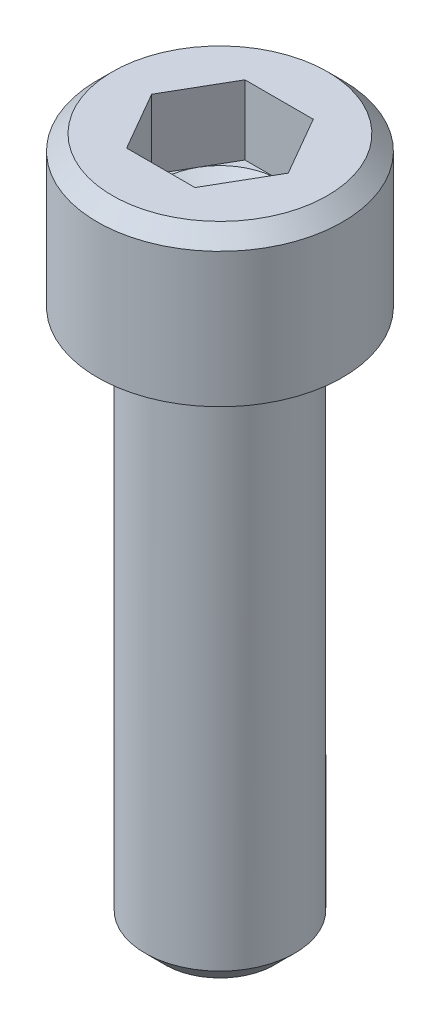
ISO-10303-21;
HEADER;
FILE_DESCRIPTION(('STEP AP214'),'2;1');
FILE_NAME('part.step','',(''),(''),'','','');
FILE_SCHEMA(('AUTOMOTIVE_DESIGN { 1 0 10303 214 1 1 1 1 }'));
ENDSEC;
DATA;
#1=APPLICATION_CONTEXT('core data for automotive mechanical design processes');
#2=APPLICATION_PROTOCOL_DEFINITION('international standard','automotive_design',2000,#1);
#3=PRODUCT_CONTEXT('',#1,'mechanical');
#4=PRODUCT('Part','Part','',(#3));
#5=PRODUCT_RELATED_PRODUCT_CATEGORY('part','',(#4));
#6=PRODUCT_DEFINITION_FORMATION('','',#4);
#7=PRODUCT_DEFINITION_CONTEXT('part definition',#1,'design');
#8=PRODUCT_DEFINITION('design','',#6,#7);
#9=PRODUCT_DEFINITION_SHAPE('','',#8);
#10=(LENGTH_UNIT() NAMED_UNIT(*) SI_UNIT(.MILLI.,.METRE.));
#11=(NAMED_UNIT(*) PLANE_ANGLE_UNIT() SI_UNIT($,.RADIAN.));
#12=(NAMED_UNIT(*) SI_UNIT($,.STERADIAN.) SOLID_ANGLE_UNIT());
#13=UNCERTAINTY_MEASURE_WITH_UNIT(LENGTH_MEASURE(1.E-05),#10,'distance_accuracy_value','');
#14=(GEOMETRIC_REPRESENTATION_CONTEXT(3) GLOBAL_UNCERTAINTY_ASSIGNED_CONTEXT((#13)) GLOBAL_UNIT_ASSIGNED_CONTEXT((#10,
#11,#12)) REPRESENTATION_CONTEXT('',''));
#15=CARTESIAN_POINT('',(0.,0.,0.));
#16=DIRECTION('',(0.,0.,1.));
#17=DIRECTION('',(1.,0.,0.));
#18=AXIS2_PLACEMENT_3D('',#15,#16,#17);
#19=CARTESIAN_POINT('',(0.,1.87960000005205,0.));
#20=DIRECTION('',(0.,1.,0.));
#21=DIRECTION('',(0.,0.,1.));
#22=AXIS2_PLACEMENT_3D('',#19,#20,#21);
#23=CONICAL_SURFACE('',#22,1.38430000009748,1.04719755120119);
#24=CARTESIAN_POINT('',(0.,1.08037402233663,5.6843418860808E-11));
#25=VERTEX_POINT('',#24);
#26=VERTEX_LOOP('',#25);
#27=FACE_BOUND('',#26,.T.);
#28=CARTESIAN_POINT('',(0.,1.87959999992078,0.));
#29=DIRECTION('',(0.,1.,0.));
#30=DIRECTION('',(0.,0.,1.));
#31=AXIS2_PLACEMENT_3D('',#28,#29,#30);
#32=CIRCLE('',#31,1.38429999987011);
#33=CARTESIAN_POINT('',(0.,1.87959999996039,-1.38429999993505));
#34=VERTEX_POINT('',#33);
#35=CARTESIAN_POINT('',(1.1988389664588,1.87959999996039,-0.692149999999999));
#36=VERTEX_POINT('',#35);
#37=EDGE_CURVE('E120',#34,#36,#32,.F.);
#38=ORIENTED_EDGE('',*,*,#37,.F.);
#39=CARTESIAN_POINT('',(0.,1.87959999998641,0.));
#40=DIRECTION('',(0.,1.,0.));
#41=DIRECTION('',(0.,0.,1.));
#42=AXIS2_PLACEMENT_3D('',#39,#40,#41);
#43=CIRCLE('',#42,1.3842999999838);
#44=CARTESIAN_POINT('',(-1.19883896645178,1.87959999999321,-0.692149999995951));
#45=VERTEX_POINT('',#44);
#46=EDGE_CURVE('E158',#45,#34,#43,.F.);
#47=ORIENTED_EDGE('',*,*,#46,.F.);
#48=CARTESIAN_POINT('',(0.,1.87959999998641,0.));
#49=DIRECTION('',(0.,1.,0.));
#50=DIRECTION('',(0.,0.,1.));
#51=AXIS2_PLACEMENT_3D('',#48,#49,#50);
#52=CIRCLE('',#51,1.3842999999838);
#53=CARTESIAN_POINT('',(-1.19883896645178,1.87960000001923,0.692149999995948));
#54=VERTEX_POINT('',#53);
#55=EDGE_CURVE('E155',#54,#45,#52,.F.);
#56=ORIENTED_EDGE('',*,*,#55,.F.);
#57=CARTESIAN_POINT('',(0.,1.87960000005205,0.));
#58=DIRECTION('',(0.,1.,0.));
#59=DIRECTION('',(0.,0.,1.));
#60=AXIS2_PLACEMENT_3D('',#57,#58,#59);
#61=CIRCLE('',#60,1.38430000009748);
#62=CARTESIAN_POINT('',(0.,1.87960000001923,1.38430000004064));
#63=VERTEX_POINT('',#62);
#64=EDGE_CURVE('E99',#63,#54,#61,.F.);
#65=ORIENTED_EDGE('',*,*,#64,.F.);
#66=CARTESIAN_POINT('',(0.,1.87959999998641,0.));
#67=DIRECTION('',(0.,1.,0.));
#68=DIRECTION('',(0.,0.,1.));
#69=AXIS2_PLACEMENT_3D('',#66,#67,#68);
#70=CIRCLE('',#69,1.3842999999838);
#71=CARTESIAN_POINT('',(1.19883896645178,1.87959999999321,0.692149999995949));
#72=VERTEX_POINT('',#71);
#73=EDGE_CURVE('E93',#72,#63,#70,.F.);
#74=ORIENTED_EDGE('',*,*,#73,.F.);
#75=CARTESIAN_POINT('',(0.,1.87959999998641,0.));
#76=DIRECTION('',(0.,1.,0.));
#77=DIRECTION('',(0.,0.,1.));
#78=AXIS2_PLACEMENT_3D('',#75,#76,#77);
#79=CIRCLE('',#78,1.3842999999838);
#80=EDGE_CURVE('E96',#36,#72,#79,.F.);
#81=ORIENTED_EDGE('',*,*,#80,.F.);
#82=EDGE_LOOP('',(#38,#47,#56,#65,#74,#81));
#83=FACE_BOUND('',#82,.T.);
#84=ADVANCED_FACE('F15',(#27,#83),#23,.F.);
#85=CARTESIAN_POINT('',(0.,1.8796,0.));
#86=DIRECTION('',(0.,1.,0.));
#87=DIRECTION('',(0.,0.,1.));
#88=AXIS2_PLACEMENT_3D('',#85,#86,#87);
#89=PLANE('',#88);
#90=DIRECTION('',(0.5,0.,-0.866025403784438));
#91=VECTOR('',#90,1.);
#92=CARTESIAN_POINT('',(0.799225977639199,1.8796,1.3843));
#93=LINE('',#92,#91);
#94=CARTESIAN_POINT('',(0.799225977639199,1.8796,1.3843));
#95=VERTEX_POINT('',#94);
#96=EDGE_CURVE('E105',#95,#72,#93,.T.);
#97=ORIENTED_EDGE('',*,*,#96,.T.);
#98=ORIENTED_EDGE('',*,*,#73,.T.);
#99=DIRECTION('',(1.,0.,0.));
#100=VECTOR('',#99,1.);
#101=CARTESIAN_POINT('',(-0.799225977639198,1.8796,1.3843));
#102=LINE('',#101,#100);
#103=EDGE_CURVE('E107',#63,#95,#102,.T.);
#104=ORIENTED_EDGE('',*,*,#103,.T.);
#105=EDGE_LOOP('',(#97,#98,#104));
#106=FACE_BOUND('',#105,.T.);
#107=ADVANCED_FACE('F106',(#106),#89,.T.);
#108=CARTESIAN_POINT('',(0.,1.8796,0.));
#109=DIRECTION('',(0.,1.,0.));
#110=DIRECTION('',(0.,0.,1.));
#111=AXIS2_PLACEMENT_3D('',#108,#109,#110);
#112=PLANE('',#111);
#113=DIRECTION('',(-0.499999999999999,0.,-0.866025403784439));
#114=VECTOR('',#113,1.);
#115=CARTESIAN_POINT('',(1.5984519552784,1.8796,0.));
#116=LINE('',#115,#114);
#117=CARTESIAN_POINT('',(1.5984519552784,1.8796,0.));
#118=VERTEX_POINT('',#117);
#119=EDGE_CURVE('E118',#118,#36,#116,.T.);
#120=ORIENTED_EDGE('',*,*,#119,.T.);
#121=ORIENTED_EDGE('',*,*,#80,.T.);
#122=DIRECTION('',(0.5,0.,-0.866025403784438));
#123=VECTOR('',#122,1.);
#124=CARTESIAN_POINT('',(0.799225977639199,1.8796,1.3843));
#125=LINE('',#124,#123);
#126=EDGE_CURVE('E112',#72,#118,#125,.T.);
#127=ORIENTED_EDGE('',*,*,#126,.T.);
#128=EDGE_LOOP('',(#120,#121,#127));
#129=FACE_BOUND('',#128,.T.);
#130=ADVANCED_FACE('F115',(#129),#112,.T.);
#131=CARTESIAN_POINT('',(0.,1.8796,0.));
#132=DIRECTION('',(0.,1.,0.));
#133=DIRECTION('',(0.,0.,1.));
#134=AXIS2_PLACEMENT_3D('',#131,#132,#133);
#135=PLANE('',#134);
#136=DIRECTION('',(-1.,0.,0.));
#137=VECTOR('',#136,1.);
#138=CARTESIAN_POINT('',(0.799225977639201,1.8796,-1.3843));
#139=LINE('',#138,#137);
#140=CARTESIAN_POINT('',(0.799225977639201,1.8796,-1.3843));
#141=VERTEX_POINT('',#140);
#142=EDGE_CURVE('E168',#141,#34,#139,.T.);
#143=ORIENTED_EDGE('',*,*,#142,.T.);
#144=ORIENTED_EDGE('',*,*,#37,.T.);
#145=DIRECTION('',(-0.499999999999999,0.,-0.866025403784439));
#146=VECTOR('',#145,1.);
#147=CARTESIAN_POINT('',(1.5984519552784,1.8796,0.));
#148=LINE('',#147,#146);
#149=EDGE_CURVE('E165',#36,#141,#148,.T.);
#150=ORIENTED_EDGE('',*,*,#149,.T.);
#151=EDGE_LOOP('',(#143,#144,#150));
#152=FACE_BOUND('',#151,.T.);
#153=ADVANCED_FACE('F164',(#152),#135,.T.);
#154=CARTESIAN_POINT('',(0.,1.8796,0.));
#155=DIRECTION('',(0.,1.,0.));
#156=DIRECTION('',(0.,0.,1.));
#157=AXIS2_PLACEMENT_3D('',#154,#155,#156);
#158=PLANE('',#157);
#159=DIRECTION('',(-0.5,0.,0.866025403784438));
#160=VECTOR('',#159,1.);
#161=CARTESIAN_POINT('',(-0.799225977639196,1.8796,-1.3843));
#162=LINE('',#161,#160);
#163=CARTESIAN_POINT('',(-0.799225977639196,1.8796,-1.3843));
#164=VERTEX_POINT('',#163);
#165=EDGE_CURVE('E183',#164,#45,#162,.T.);
#166=ORIENTED_EDGE('',*,*,#165,.T.);
#167=ORIENTED_EDGE('',*,*,#46,.T.);
#168=DIRECTION('',(-1.,0.,0.));
#169=VECTOR('',#168,1.);
#170=CARTESIAN_POINT('',(0.799225977639201,1.8796,-1.3843));
#171=LINE('',#170,#169);
#172=EDGE_CURVE('E184',#34,#164,#171,.T.);
#173=ORIENTED_EDGE('',*,*,#172,.T.);
#174=EDGE_LOOP('',(#166,#167,#173));
#175=FACE_BOUND('',#174,.T.);
#176=ADVANCED_FACE('F328',(#175),#158,.T.);
#177=CARTESIAN_POINT('',(0.,1.8796,0.));
#178=DIRECTION('',(0.,1.,0.));
#179=DIRECTION('',(0.,0.,1.));
#180=AXIS2_PLACEMENT_3D('',#177,#178,#179);
#181=PLANE('',#180);
#182=DIRECTION('',(0.5,0.,0.866025403784439));
#183=VECTOR('',#182,1.);
#184=CARTESIAN_POINT('',(-1.5984519552784,1.8796,0.));
#185=LINE('',#184,#183);
#186=CARTESIAN_POINT('',(-1.5984519552784,1.8796,0.));
#187=VERTEX_POINT('',#186);
#188=EDGE_CURVE('E196',#187,#54,#185,.T.);
#189=ORIENTED_EDGE('',*,*,#188,.T.);
#190=ORIENTED_EDGE('',*,*,#55,.T.);
#191=DIRECTION('',(-0.5,0.,0.866025403784438));
#192=VECTOR('',#191,1.);
#193=CARTESIAN_POINT('',(-0.799225977639196,1.8796,-1.3843));
#194=LINE('',#193,#192);
#195=EDGE_CURVE('E197',#45,#187,#194,.T.);
#196=ORIENTED_EDGE('',*,*,#195,.T.);
#197=EDGE_LOOP('',(#189,#190,#196));
#198=FACE_BOUND('',#197,.T.);
#199=ADVANCED_FACE('F324',(#198),#181,.T.);
#200=CARTESIAN_POINT('',(0.,1.8796,0.));
#201=DIRECTION('',(0.,1.,0.));
#202=DIRECTION('',(0.,0.,1.));
#203=AXIS2_PLACEMENT_3D('',#200,#201,#202);
#204=PLANE('',#203);
#205=DIRECTION('',(1.,0.,0.));
#206=VECTOR('',#205,1.);
#207=CARTESIAN_POINT('',(-0.799225977639198,1.8796,1.3843));
#208=LINE('',#207,#206);
#209=CARTESIAN_POINT('',(-0.799225977639198,1.8796,1.3843));
#210=VERTEX_POINT('',#209);
#211=EDGE_CURVE('E139',#210,#63,#208,.T.);
#212=ORIENTED_EDGE('',*,*,#211,.T.);
#213=ORIENTED_EDGE('',*,*,#64,.T.);
#214=DIRECTION('',(0.5,0.,0.866025403784439));
#215=VECTOR('',#214,1.);
#216=CARTESIAN_POINT('',(-1.5984519552784,1.8796,0.));
#217=LINE('',#216,#215);
#218=EDGE_CURVE('E215',#54,#210,#217,.T.);
#219=ORIENTED_EDGE('',*,*,#218,.T.);
#220=EDGE_LOOP('',(#212,#213,#219));
#221=FACE_BOUND('',#220,.T.);
#222=ADVANCED_FACE('F320',(#221),#204,.T.);
#223=CARTESIAN_POINT('',(-0.799225977639198,3.5052,1.3843));
#224=DIRECTION('',(0.,0.,1.));
#225=DIRECTION('',(1.,0.,0.));
#226=AXIS2_PLACEMENT_3D('',#223,#224,#225);
#227=PLANE('',#226);
#228=DIRECTION('',(1.,0.,0.));
#229=VECTOR('',#228,1.);
#230=CARTESIAN_POINT('',(0.,3.5052,1.3843));
#231=LINE('',#230,#229);
#232=CARTESIAN_POINT('',(-0.799225977639198,3.5052,1.3843));
#233=VERTEX_POINT('',#232);
#234=CARTESIAN_POINT('',(0.799225977639199,3.5052,1.3843));
#235=VERTEX_POINT('',#234);
#236=EDGE_CURVE('E210',#233,#235,#231,.T.);
#237=ORIENTED_EDGE('',*,*,#236,.T.);
#238=DIRECTION('',(0.,1.,0.));
#239=VECTOR('',#238,1.);
#240=CARTESIAN_POINT('',(0.799225977639199,3.5052,1.3843));
#241=LINE('',#240,#239);
#242=EDGE_CURVE('E125',#235,#95,#241,.F.);
#243=ORIENTED_EDGE('',*,*,#242,.T.);
#244=ORIENTED_EDGE('',*,*,#103,.F.);
#245=ORIENTED_EDGE('',*,*,#211,.F.);
#246=DIRECTION('',(0.,1.,0.));
#247=VECTOR('',#246,1.);
#248=CARTESIAN_POINT('',(-0.799225977639198,3.5052,1.3843));
#249=LINE('',#248,#247);
#250=EDGE_CURVE('E211',#210,#233,#249,.T.);
#251=ORIENTED_EDGE('',*,*,#250,.T.);
#252=EDGE_LOOP('',(#237,#243,#244,#245,#251));
#253=FACE_BOUND('',#252,.T.);
#254=ADVANCED_FACE('F317',(#253),#227,.F.);
#255=CARTESIAN_POINT('',(0.799225977639199,3.5052,1.3843));
#256=DIRECTION('',(0.866025403784438,0.,0.5));
#257=DIRECTION('',(0.5,0.,-0.866025403784438));
#258=AXIS2_PLACEMENT_3D('',#255,#256,#257);
#259=PLANE('',#258);
#260=DIRECTION('',(0.5,0.,-0.866025403784438));
#261=VECTOR('',#260,1.);
#262=CARTESIAN_POINT('',(0.799225977639199,3.5052,1.3843));
#263=LINE('',#262,#261);
#264=CARTESIAN_POINT('',(1.5984519552784,3.5052,0.));
#265=VERTEX_POINT('',#264);
#266=EDGE_CURVE('E227',#235,#265,#263,.T.);
#267=ORIENTED_EDGE('',*,*,#266,.T.);
#268=DIRECTION('',(0.,1.,0.));
#269=VECTOR('',#268,1.);
#270=CARTESIAN_POINT('',(1.5984519552784,3.5052,0.));
#271=LINE('',#270,#269);
#272=EDGE_CURVE('E124',#265,#118,#271,.F.);
#273=ORIENTED_EDGE('',*,*,#272,.T.);
#274=ORIENTED_EDGE('',*,*,#126,.F.);
#275=ORIENTED_EDGE('',*,*,#96,.F.);
#276=ORIENTED_EDGE('',*,*,#242,.F.);
#277=EDGE_LOOP('',(#267,#273,#274,#275,#276));
#278=FACE_BOUND('',#277,.T.);
#279=ADVANCED_FACE('F122',(#278),#259,.F.);
#280=CARTESIAN_POINT('',(1.5984519552784,3.5052,0.));
#281=DIRECTION('',(0.866025403784439,0.,-0.499999999999999));
#282=DIRECTION('',(-0.499999999999999,0.,-0.866025403784439));
#283=AXIS2_PLACEMENT_3D('',#280,#281,#282);
#284=PLANE('',#283);
#285=DIRECTION('',(-0.499999999999999,0.,-0.866025403784439));
#286=VECTOR('',#285,1.);
#287=CARTESIAN_POINT('',(1.5984519552784,3.5052,0.));
#288=LINE('',#287,#286);
#289=CARTESIAN_POINT('',(0.799225977639201,3.5052,-1.3843));
#290=VERTEX_POINT('',#289);
#291=EDGE_CURVE('E229',#265,#290,#288,.T.);
#292=ORIENTED_EDGE('',*,*,#291,.T.);
#293=DIRECTION('',(0.,1.,0.));
#294=VECTOR('',#293,1.);
#295=CARTESIAN_POINT('',(0.799225977639201,3.5052,-1.3843));
#296=LINE('',#295,#294);
#297=EDGE_CURVE('E172',#290,#141,#296,.F.);
#298=ORIENTED_EDGE('',*,*,#297,.T.);
#299=ORIENTED_EDGE('',*,*,#149,.F.);
#300=ORIENTED_EDGE('',*,*,#119,.F.);
#301=ORIENTED_EDGE('',*,*,#272,.F.);
#302=EDGE_LOOP('',(#292,#298,#299,#300,#301));
#303=FACE_BOUND('',#302,.T.);
#304=ADVANCED_FACE('F170',(#303),#284,.F.);
#305=CARTESIAN_POINT('',(0.799225977639201,3.5052,-1.3843));
#306=DIRECTION('',(0.,0.,-1.));
#307=DIRECTION('',(-1.,0.,0.));
#308=AXIS2_PLACEMENT_3D('',#305,#306,#307);
#309=PLANE('',#308);
#310=DIRECTION('',(1.,0.,0.));
#311=VECTOR('',#310,1.);
#312=CARTESIAN_POINT('',(0.,3.5052,-1.3843));
#313=LINE('',#312,#311);
#314=CARTESIAN_POINT('',(-0.799225977639196,3.5052,-1.3843));
#315=VERTEX_POINT('',#314);
#316=EDGE_CURVE('E231',#290,#315,#313,.F.);
#317=ORIENTED_EDGE('',*,*,#316,.T.);
#318=DIRECTION('',(0.,1.,0.));
#319=VECTOR('',#318,1.);
#320=CARTESIAN_POINT('',(-0.799225977639196,3.5052,-1.3843));
#321=LINE('',#320,#319);
#322=EDGE_CURVE('E193',#315,#164,#321,.F.);
#323=ORIENTED_EDGE('',*,*,#322,.T.);
#324=ORIENTED_EDGE('',*,*,#172,.F.);
#325=ORIENTED_EDGE('',*,*,#142,.F.);
#326=ORIENTED_EDGE('',*,*,#297,.F.);
#327=EDGE_LOOP('',(#317,#323,#324,#325,#326));
#328=FACE_BOUND('',#327,.T.);
#329=ADVANCED_FACE('F308',(#328),#309,.F.);
#330=CARTESIAN_POINT('',(-0.799225977639196,3.5052,-1.3843));
#331=DIRECTION('',(-0.866025403784438,0.,-0.5));
#332=DIRECTION('',(-0.5,0.,0.866025403784438));
#333=AXIS2_PLACEMENT_3D('',#330,#331,#332);
#334=PLANE('',#333);
#335=DIRECTION('',(-0.500000000000001,0.,0.866025403784438));
#336=VECTOR('',#335,1.);
#337=CARTESIAN_POINT('',(-0.799225977639196,3.5052,-1.3843));
#338=LINE('',#337,#336);
#339=CARTESIAN_POINT('',(-1.5984519552784,3.5052,0.));
#340=VERTEX_POINT('',#339);
#341=EDGE_CURVE('E233',#315,#340,#338,.T.);
#342=ORIENTED_EDGE('',*,*,#341,.T.);
#343=DIRECTION('',(0.,1.,0.));
#344=VECTOR('',#343,1.);
#345=CARTESIAN_POINT('',(-1.5984519552784,3.5052,0.));
#346=LINE('',#345,#344);
#347=EDGE_CURVE('E207',#340,#187,#346,.F.);
#348=ORIENTED_EDGE('',*,*,#347,.T.);
#349=ORIENTED_EDGE('',*,*,#195,.F.);
#350=ORIENTED_EDGE('',*,*,#165,.F.);
#351=ORIENTED_EDGE('',*,*,#322,.F.);
#352=EDGE_LOOP('',(#342,#348,#349,#350,#351));
#353=FACE_BOUND('',#352,.T.);
#354=ADVANCED_FACE('F304',(#353),#334,.F.);
#355=CARTESIAN_POINT('',(-1.5984519552784,3.5052,0.));
#356=DIRECTION('',(-0.866025403784439,0.,0.5));
#357=DIRECTION('',(0.5,0.,0.866025403784439));
#358=AXIS2_PLACEMENT_3D('',#355,#356,#357);
#359=PLANE('',#358);
#360=DIRECTION('',(0.5,0.,0.866025403784439));
#361=VECTOR('',#360,1.);
#362=CARTESIAN_POINT('',(-1.5984519552784,3.5052,0.));
#363=LINE('',#362,#361);
#364=EDGE_CURVE('E153',#340,#233,#363,.T.);
#365=ORIENTED_EDGE('',*,*,#364,.T.);
#366=ORIENTED_EDGE('',*,*,#250,.F.);
#367=ORIENTED_EDGE('',*,*,#218,.F.);
#368=ORIENTED_EDGE('',*,*,#188,.F.);
#369=ORIENTED_EDGE('',*,*,#347,.F.);
#370=EDGE_LOOP('',(#365,#366,#367,#368,#369));
#371=FACE_BOUND('',#370,.T.);
#372=ADVANCED_FACE('F300',(#371),#359,.F.);
#373=CARTESIAN_POINT('',(0.,3.5052,0.));
#374=DIRECTION('',(0.,-1.,0.));
#375=DIRECTION('',(0.,0.,-1.));
#376=AXIS2_PLACEMENT_3D('',#373,#374,#375);
#377=PLANE('',#376);
#378=ORIENTED_EDGE('',*,*,#341,.F.);
#379=ORIENTED_EDGE('',*,*,#316,.F.);
#380=ORIENTED_EDGE('',*,*,#291,.F.);
#381=ORIENTED_EDGE('',*,*,#266,.F.);
#382=ORIENTED_EDGE('',*,*,#236,.F.);
#383=ORIENTED_EDGE('',*,*,#364,.F.);
#384=EDGE_LOOP('',(#378,#379,#380,#381,#382,#383));
#385=FACE_BOUND('',#384,.T.);
#386=CARTESIAN_POINT('',(0.,3.50520000006327,0.));
#387=DIRECTION('',(0.,-1.,0.));
#388=DIRECTION('',(0.,0.,-1.));
#389=AXIS2_PLACEMENT_3D('',#386,#387,#388);
#390=CIRCLE('',#389,2.5145999999836);
#391=CARTESIAN_POINT('',(0.,3.50520000006327,-2.5145999999836));
#392=VERTEX_POINT('',#391);
#393=EDGE_CURVE('E150',#392,#392,#390,.T.);
#394=ORIENTED_EDGE('',*,*,#393,.F.);
#395=EDGE_LOOP('',(#394));
#396=FACE_BOUND('',#395,.T.);
#397=ADVANCED_FACE('F296',(#385,#396),#377,.F.);
#398=CARTESIAN_POINT('',(0.,3.14960000008568,0.));
#399=DIRECTION('',(0.,-1.,0.));
#400=DIRECTION('',(0.,0.,-1.));
#401=AXIS2_PLACEMENT_3D('',#398,#399,#400);
#402=CONICAL_SURFACE('',#401,2.87019999990434,0.785398163317522);
#403=CARTESIAN_POINT('',(0.,3.1496,0.));
#404=DIRECTION('',(0.,-1.,0.));
#405=DIRECTION('',(0.,0.,-1.));
#406=AXIS2_PLACEMENT_3D('',#403,#404,#405);
#407=CIRCLE('',#406,2.8702);
#408=CARTESIAN_POINT('',(0.,3.1496,-2.8702));
#409=VERTEX_POINT('',#408);
#410=EDGE_CURVE('E149',#409,#409,#407,.T.);
#411=ORIENTED_EDGE('',*,*,#410,.F.);
#412=EDGE_LOOP('',(#411));
#413=FACE_BOUND('',#412,.T.);
#414=ORIENTED_EDGE('',*,*,#393,.T.);
#415=EDGE_LOOP('',(#414));
#416=FACE_BOUND('',#415,.T.);
#417=ADVANCED_FACE('F292',(#413,#416),#402,.T.);
#418=CARTESIAN_POINT('',(0.,4.31546,0.));
#419=DIRECTION('',(0.,-1.,0.));
#420=DIRECTION('',(0.,0.,-1.));
#421=AXIS2_PLACEMENT_3D('',#418,#419,#420);
#422=CYLINDRICAL_SURFACE('',#421,2.8702);
#423=CARTESIAN_POINT('',(0.,0.,0.));
#424=DIRECTION('',(0.,-1.,0.));
#425=DIRECTION('',(0.,0.,-1.));
#426=AXIS2_PLACEMENT_3D('',#423,#424,#425);
#427=CIRCLE('',#426,2.8702);
#428=CARTESIAN_POINT('',(0.,0.,-2.8702));
#429=VERTEX_POINT('',#428);
#430=EDGE_CURVE('E146',#429,#429,#427,.T.);
#431=ORIENTED_EDGE('',*,*,#430,.F.);
#432=EDGE_LOOP('',(#431));
#433=FACE_BOUND('',#432,.T.);
#434=ORIENTED_EDGE('',*,*,#410,.T.);
#435=EDGE_LOOP('',(#434));
#436=FACE_BOUND('',#435,.T.);
#437=ADVANCED_FACE('F288',(#433,#436),#422,.T.);
#438=CARTESIAN_POINT('',(0.,-12.7,0.));
#439=DIRECTION('',(0.,-1.,0.));
#440=DIRECTION('',(0.,0.,-1.));
#441=AXIS2_PLACEMENT_3D('',#438,#439,#440);
#442=PLANE('',#441);
#443=CARTESIAN_POINT('',(0.,-12.7000000000521,0.));
#444=DIRECTION('',(0.,1.,0.));
#445=DIRECTION('',(-1.,0.,0.));
#446=AXIS2_PLACEMENT_3D('',#443,#444,#445);
#447=CIRCLE('',#446,1.28015999990794);
#448=CARTESIAN_POINT('',(-1.28015999990794,-12.7000000000521,0.));
#449=VERTEX_POINT('',#448);
#450=EDGE_CURVE('E142',#449,#449,#447,.T.);
#451=ORIENTED_EDGE('',*,*,#450,.F.);
#452=EDGE_LOOP('',(#451));
#453=FACE_BOUND('',#452,.T.);
#454=ADVANCED_FACE('F277',(#453),#442,.T.);
#455=CARTESIAN_POINT('',(0.,0.,0.));
#456=DIRECTION('',(0.,-1.,0.));
#457=DIRECTION('',(0.,0.,-1.));
#458=AXIS2_PLACEMENT_3D('',#455,#456,#457);
#459=PLANE('',#458);
#460=CARTESIAN_POINT('',(-2.0066,0.,0.));
#461=CARTESIAN_POINT('',(-2.00657265962007,-1.18138069234208E-09,-0.0210580869790664));
#462=CARTESIAN_POINT('',(-2.00622029585131,-4.51579249453679E-09,-0.0421157418712343));
#463=CARTESIAN_POINT('',(-2.00486644591824,-1.0744714254954E-08,-0.0842091433471788));
#464=CARTESIAN_POINT('',(-2.00386499154321,-1.36392457477874E-08,-0.105244890953335));
#465=CARTESIAN_POINT('',(-2.0012139196371,-1.4243479539218E-08,-0.147274902257008));
#466=CARTESIAN_POINT('',(-1.9995643205467,-1.19533293409575E-08,-0.168269167117692));
#467=CARTESIAN_POINT('',(-1.99561819947604,-5.03562863039677E-09,-0.210196654627567));
#468=CARTESIAN_POINT('',(-1.99332168262399,-4.08096646669477E-10,-0.231129877759317));
#469=CARTESIAN_POINT('',(-1.98808534919676,2.22729586447697E-10,-0.272915892807738));
#470=CARTESIAN_POINT('',(-1.98514552451971,-3.77408478539003E-09,-0.293768683708075));
#471=CARTESIAN_POINT('',(-1.97861983055974,-2.9787937906619E-08,-0.335374092754159));
#472=CARTESIAN_POINT('',(-1.97503393988664,-5.18055733812033E-08,-0.356126707559875));
#473=CARTESIAN_POINT('',(-1.97016272517689,-1.19356101237747E-07,-0.38199323573332));
#474=CARTESIAN_POINT('',(-1.96916898774596,-1.34868584674883E-07,-0.387163090621001));
#475=CARTESIAN_POINT('',(-1.96661004530803,-1.64843392380194E-07,-0.400146025372519));
#476=CARTESIAN_POINT('',(-1.96501346459741,-1.74674506404736E-07,-0.407952953102212));
#477=CARTESIAN_POINT('',(-1.95960879410844,-1.92843694994388E-07,-0.433546965264064));
#478=CARTESIAN_POINT('',(-1.95559104861714,-1.83089030820071E-07,-0.451289844490835));
#479=CARTESIAN_POINT('',(-1.94504402546392,-1.53127174430954E-07,-0.49506471498493));
#480=CARTESIAN_POINT('',(-1.93822862677839,-1.30155607920567E-07,-0.521028481752085));
#481=CARTESIAN_POINT('',(-1.92753076318256,-9.61642778878135E-08,-0.55866632291437));
#482=CARTESIAN_POINT('',(-1.92406041602379,-8.54138363940265E-08,-0.570459281940301));
#483=CARTESIAN_POINT('',(-1.91434341198029,-5.86606028963676E-08,-0.602391710978674));
#484=CARTESIAN_POINT('',(-1.9078864456888,-4.44011620970092E-08,-0.622467650702659));
#485=CARTESIAN_POINT('',(-1.8929291824866,-1.97550235426723E-08,-0.666580087640053));
#486=CARTESIAN_POINT('',(-1.8842838541625,-1.08002648142721E-08,-0.690567553347001));
#487=CARTESIAN_POINT('',(-1.86970772869468,-2.62336730863271E-09,-0.728716566432006));
#488=CARTESIAN_POINT('',(-1.86406596540686,-9.46138721409976E-10,-0.742989201794473));
#489=CARTESIAN_POINT('',(-1.85680370053632,-2.30897950968672E-10,-0.760778373360141));
#490=CARTESIAN_POINT('',(-1.85533152224185,-1.5717867250579E-10,-0.764355743382793));
#491=CARTESIAN_POINT('',(-1.84982187903881,2.99267942845842E-11,-0.777640375737722));
#492=CARTESIAN_POINT('',(-1.8457217658675,-6.06731934390713E-12,-0.787321719529376));
#493=CARTESIAN_POINT('',(-1.83319525496655,-2.96354093563905E-11,-0.816267344739816));
#494=CARTESIAN_POINT('',(-1.82454232197486,6.71935545025339E-11,-0.835434138600971));
#495=CARTESIAN_POINT('',(-1.80664698000181,-5.76417785580656E-10,-0.873489809602051));
#496=CARTESIAN_POINT('',(-1.79740457826403,-1.31684780288271E-09,-0.892378690153555));
#497=CARTESIAN_POINT('',(-1.77833729681665,-6.39512212748439E-09,-0.929860253592896));
#498=CARTESIAN_POINT('',(-1.76851241716164,-1.07329660975851E-08,-0.948452936508496));
#499=CARTESIAN_POINT('',(-1.74829067904858,-2.96811195151383E-08,-0.985324891585138));
#500=CARTESIAN_POINT('',(-1.73789381367227,-4.42915532362572E-08,-1.00360415995188));
#501=CARTESIAN_POINT('',(-1.71653529433852,-8.69046137596123E-08,-1.03983028232889));
#502=CARTESIAN_POINT('',(-1.7055736266695,-1.14907565825518E-07,-1.05777712825463));
#503=CARTESIAN_POINT('',(-1.68591406019005,-1.99456028629598E-07,-1.08888356419789));
#504=CARTESIAN_POINT('',(-1.67733520613763,-2.47117266010128E-07,-1.10211844289603));
#505=CARTESIAN_POINT('',(-1.66737381375109,-2.94344812274935E-07,-1.11707881342226));
#506=CARTESIAN_POINT('',(-1.66614977744434,-3.00011691604184E-07,-1.11891026892562));
#507=CARTESIAN_POINT('',(-1.6570815740461,-3.3447624672053E-07,-1.13242165201303));
#508=CARTESIAN_POINT('',(-1.64909600073653,-3.2342806641006E-07,-1.14400690194099));
#509=CARTESIAN_POINT('',(-1.62803152507953,-2.86673191856411E-07,-1.1738799676263));
#510=CARTESIAN_POINT('',(-1.61476209482821,-2.5615170630929E-07,-1.192033612083));
#511=CARTESIAN_POINT('',(-1.58514329561223,-1.83763241924945E-07,-1.231138460138));
#512=CARTESIAN_POINT('',(-1.56867273852688,-1.40842401007272E-07,-1.25199788121866));
#513=CARTESIAN_POINT('',(-1.53105412546996,-6.45470059583128E-08,-1.29774177671425));
#514=CARTESIAN_POINT('',(-1.50969786801119,-3.5601337320746E-08,-1.32245561786635));
#515=CARTESIAN_POINT('',(-1.47391005815015,-8.79942974353063E-09,-1.36189036596484));
#516=CARTESIAN_POINT('',(-1.45983147774953,-3.41213355736081E-09,-1.37693332546894));
#517=CARTESIAN_POINT('',(-1.43672876564567,-3.98930068617225E-11,-1.40088141777535));
#518=CARTESIAN_POINT('',(-1.42784396534533,-4.42161013124796E-12,-1.40992128593877));
#519=CARTESIAN_POINT('',(-1.40400104565798,-4.38017879631791E-11,-1.43374097286032));
#520=CARTESIAN_POINT('',(-1.38889917922115,-2.06762712309779E-10,-1.44837749910195));
#521=CARTESIAN_POINT('',(-1.35824606276434,-5.92887091397788E-11,-1.47717121815157));
#522=CARTESIAN_POINT('',(-1.34269482149906,2.5113700196883E-10,-1.49132842028607));
#523=CARTESIAN_POINT('',(-1.31116123390567,-7.60799874179211E-10,-1.51915408644455));
#524=CARTESIAN_POINT('',(-1.29517889060058,-2.08315101479915E-09,-1.53282255389412));
#525=CARTESIAN_POINT('',(-1.26279717255862,-1.01179751458662E-08,-1.55965644571635));
#526=CARTESIAN_POINT('',(-1.24639779555047,-1.68304774985024E-08,-1.57282186734831));
#527=CARTESIAN_POINT('',(-1.21319874364761,-4.43455625258121E-08,-1.59863839855105));
#528=CARTESIAN_POINT('',(-1.19639906159105,-6.51483974727779E-08,-1.61128949890916));
#529=CARTESIAN_POINT('',(-1.16241200482726,-1.22525270935869E-07,-1.63606167283223));
#530=CARTESIAN_POINT('',(-1.14522461836517,-1.59099788246261E-07,-1.64818273029393));
#531=CARTESIAN_POINT('',(-1.12351619684219,-2.39185297873983E-07,-1.66300383966422));
#532=CARTESIAN_POINT('',(-1.11916309833965,-2.5692173288858E-07,-1.66595168770452));
#533=CARTESIAN_POINT('',(-1.10802640445425,-2.89544204459569E-07,-1.673418232856));
#534=CARTESIAN_POINT('',(-1.10122373608347,-2.9748883255834E-07,-1.67790854334287));
#535=CARTESIAN_POINT('',(-1.07908399218167,-3.05539980384313E-07,-1.69231647013462));
#536=CARTESIAN_POINT('',(-1.06363044818555,-2.83690405443187E-07,-1.70205525234456));
#537=CARTESIAN_POINT('',(-1.02524736615806,-2.24832108540568E-07,-1.72551031966852));
#538=CARTESIAN_POINT('',(-1.00216745087154,-1.85487272449725E-07,-1.73898178855467));
#539=CARTESIAN_POINT('',(-0.96817100797543,-1.31270093645425E-07,-1.75791794415904));
#540=CARTESIAN_POINT('',(-0.957460280351814,-1.14717656821029E-07,-1.76375547679127));
#541=CARTESIAN_POINT('',(-0.929656357810539,-7.62813871770214E-08,-1.77858166901176));
#542=CARTESIAN_POINT('',(-0.912484011517385,-5.69184720251855E-08,-1.78742250324411));
#543=CARTESIAN_POINT('',(-0.873221524754553,-2.32892611003406E-08,-1.80692715390729));
#544=CARTESIAN_POINT('',(-0.851055516816136,-1.18108694374296E-08,-1.81743862931142));
#545=CARTESIAN_POINT('',(-0.813501009591488,-1.84000746588702E-09,-1.8344153466416));
#546=CARTESIAN_POINT('',(-0.798211213146529,-3.69178311273611E-10,-1.84109983798073));
#547=CARTESIAN_POINT('',(-0.777867656332008,3.29318312188803E-11,-1.84970358034275));
#548=CARTESIAN_POINT('',(-0.772883636946291,8.93146269367929E-12,-1.85178856821615));
#549=CARTESIAN_POINT('',(-0.758176394873978,-5.80123738398463E-11,-1.85787423615137));
#550=CARTESIAN_POINT('',(-0.748430814821295,-9.73940312489769E-11,-1.86182099071734));
#551=CARTESIAN_POINT('',(-0.719103902561635,-8.71218465078563E-11,-1.87343218721048));
#552=CARTESIAN_POINT('',(-0.699431489846735,9.09333645039049E-11,-1.88086795480757));
#553=CARTESIAN_POINT('',(-0.659866193432577,-1.21439009896253E-10,-1.89512578632479));
#554=CARTESIAN_POINT('',(-0.639973312456367,-5.1185958169895E-10,-1.90194785781532));
#555=CARTESIAN_POINT('',(-0.599985121114591,-4.81007008931552E-09,-1.91497073347239));
#556=CARTESIAN_POINT('',(-0.579889810766287,-8.71785972519699E-09,-1.92117153769189));
#557=CARTESIAN_POINT('',(-0.539516311852809,-2.68430252339569E-08,-1.93294701980541));
#558=CARTESIAN_POINT('',(-0.519238121065673,-4.10605265348846E-08,-1.93852169008092));
#559=CARTESIAN_POINT('',(-0.478517395162108,-8.31226222759927E-08,-1.94903658055754));
#560=CARTESIAN_POINT('',(-0.45807485604505,-1.10967549433958E-07,-1.95397678526425));
#561=CARTESIAN_POINT('',(-0.422175859932622,-1.95516211970378E-07,-1.96207254941081));
#562=CARTESIAN_POINT('',(-0.406750349661129,-2.43266501959587E-07,-1.965365532436));
#563=CARTESIAN_POINT('',(-0.389123039965533,-2.90898720857794E-07,-1.96890189662729));
#564=CARTESIAN_POINT('',(-0.386958396123352,-2.96629164442749E-07,-1.96933228022704));
#565=CARTESIAN_POINT('',(-0.370978645298617,-3.31538626664974E-07,-1.97247713948066));
#566=CARTESIAN_POINT('',(-0.357130443173501,-3.21032727397736E-07,-1.97502443212388));
#567=CARTESIAN_POINT('',(-0.321103998655701,-2.855266968177E-07,-1.98125460158306));
#568=CARTESIAN_POINT('',(-0.298885943891845,-2.55618478192055E-07,-1.98470810219464));
#569=CARTESIAN_POINT('',(-0.250302706205466,-1.84298979339763E-07,-1.99141427703287));
#570=CARTESIAN_POINT('',(-0.223916780868404,-1.41785129429685E-07,-1.99451671713783));
#571=CARTESIAN_POINT('',(-0.164903208009986,-6.58106408162129E-08,-2.00026972168635));
#572=CARTESIAN_POINT('',(-0.132248565014165,-3.6742869292508E-08,-2.00264818548024));
#573=CARTESIAN_POINT('',(-0.0789838607269858,-9.53058686004576E-09,-2.00522505173842));
#574=CARTESIAN_POINT('',(-0.0583957843104372,-3.91761188404913E-09,-2.00590474294566));
#575=CARTESIAN_POINT('',(-0.0252030346619793,-2.25235502191792E-10,-2.00649772630409));
#576=CARTESIAN_POINT('',(-0.0126016122787181,-6.72510909721797E-11,-2.00660609966816));
#577=CARTESIAN_POINT('',(0.0210297218166208,1.1222953998373E-10,-2.00658982079037));
#578=CARTESIAN_POINT('',(0.0420599584174132,-2.82276883143848E-11,-2.00626084116106));
#579=CARTESIAN_POINT('',(0.0840992694181111,-5.97179246067057E-11,-2.00494623623446));
#580=CARTESIAN_POINT('',(0.105108344231243,4.92440986719829E-11,-2.00396062401836));
#581=CARTESIAN_POINT('',(0.147085648242751,-9.98978491728006E-10,-2.00133858548951));
#582=CARTESIAN_POINT('',(0.168053877738748,-2.15615384478845E-09,-1.99970216393688));
#583=CARTESIAN_POINT('',(0.209929854325517,-1.23851758475523E-08,-1.99578005330813));
#584=CARTESIAN_POINT('',(0.230837601095597,-2.14570643856848E-08,-1.99349436079579));
#585=CARTESIAN_POINT('',(0.272571220727236,-4.61070454767165E-08,-1.98827117740893));
#586=CARTESIAN_POINT('',(0.293397092116712,-6.16852544753043E-08,-1.98533367486921));
#587=CARTESIAN_POINT('',(0.340146986529759,-1.49541136741018E-07,-1.97801546082655));
#588=CARTESIAN_POINT('',(0.366043844717127,-2.35020827392998E-07,-1.97345754140454));
#589=CARTESIAN_POINT('',(0.399892759940074,-3.00348103069025E-07,-1.96676555031465));
#590=CARTESIAN_POINT('',(0.407942910893439,-3.12416163346358E-07,-1.96511911758243));
#591=CARTESIAN_POINT('',(0.433872518712849,-3.27809070160617E-07,-1.95963505669955));
#592=CARTESIAN_POINT('',(0.451707294433869,-3.02293240221054E-07,-1.95558488369261));
#593=CARTESIAN_POINT('',(0.495402603758563,-2.38003909249426E-07,-1.94502732810633));
#594=CARTESIAN_POINT('',(0.521197093500319,-1.98511606674988E-07,-1.93824423665579));
#595=CARTESIAN_POINT('',(0.558537580670413,-1.42069980917264E-07,-1.92761692099217));
#596=CARTESIAN_POINT('',(0.57020147071396,-1.24544129631929E-07,-1.92418123972585));
#597=CARTESIAN_POINT('',(0.600590639014264,-8.33166781902832E-08,-1.91492872748077));
#598=CARTESIAN_POINT('',(0.619264662125532,-6.24085795170103E-08,-1.90894250480629));
#599=CARTESIAN_POINT('',(0.661247697104759,-2.60036492135372E-08,-1.89480495331359));
#600=CARTESIAN_POINT('',(0.68450334588518,-1.33145869236484E-08,-1.88649463809623));
#601=CARTESIAN_POINT('',(0.723002300915327,-2.21848439316869E-09,-1.87193367492234));
#602=CARTESIAN_POINT('',(0.738335136359425,-4.62775780716873E-10,-1.86591858047966));
#603=CARTESIAN_POINT('',(0.758367087167688,2.91058363845665E-11,-1.85778386544522));
#604=CARTESIAN_POINT('',(0.763132968431145,1.11747111019027E-11,-1.85582782022805));
#605=CARTESIAN_POINT('',(0.777604340211613,-6.475649469707E-11,-1.84982591288707));
#606=CARTESIAN_POINT('',(0.787286821208619,-1.45036983562982E-10,-1.84572445856802));
#607=CARTESIAN_POINT('',(0.81623600485876,-2.25323470894912E-10,-1.83319440595961));
#608=CARTESIAN_POINT('',(0.835405406251411,-6.47980828473738E-11,-1.82453973836788));
#609=CARTESIAN_POINT('',(0.87346623097398,1.14554342025861E-11,-1.80664090687535));
#610=CARTESIAN_POINT('',(0.892357658326458,-7.28128908780499E-11,-1.79739675151537));
#611=CARTESIAN_POINT('',(0.929844305752205,-2.87900986344135E-09,-1.77832608445034));
#612=CARTESIAN_POINT('',(0.948439526318668,-5.60093411865327E-09,-1.76849957371505));
#613=CARTESIAN_POINT('',(0.98531701029644,-2.20769216037402E-08,-1.74827535374271));
#614=CARTESIAN_POINT('',(1.00359927021467,-3.58311078872964E-08,-1.73787763813564));
#615=CARTESIAN_POINT('',(1.03983008852533,-7.22809968398378E-08,-1.71651535455001));
#616=CARTESIAN_POINT('',(1.05777863890768,-9.49769138496146E-08,-1.70555077298865));
#617=CARTESIAN_POINT('',(1.08889275575461,-1.85473058778122E-07,-1.68589361220713));
#618=CARTESIAN_POINT('',(1.10213243722152,-2.4058078087945E-07,-1.67731820123325));
#619=CARTESIAN_POINT('',(1.12878401324222,-2.99571464284316E-07,-1.6595565579701));
#620=CARTESIAN_POINT('',(1.14218881296398,-3.01838135786639E-07,-1.65035966863575));
#621=CARTESIAN_POINT('',(1.17385546080573,-2.80202081899918E-07,-1.62804280422505));
#622=CARTESIAN_POINT('',(1.19200983314254,-2.45936824583088E-07,-1.6147701710475));
#623=CARTESIAN_POINT('',(1.23112763652927,-1.72568870199489E-07,-1.5851408875302));
#624=CARTESIAN_POINT('',(1.25199944067529,-1.3372383628496E-07,-1.56866329328474));
#625=CARTESIAN_POINT('',(1.29787512771837,-6.26868927606766E-08,-1.53093966126523));
#626=CARTESIAN_POINT('',(1.32270374521501,-3.41757953454795E-08,-1.50947969739985));
#627=CARTESIAN_POINT('',(1.36223674182792,-8.2391786549516E-09,-1.47358726392721));
#628=CARTESIAN_POINT('',(1.37726852778499,-3.19185007607626E-09,-1.45951341488453));
#629=CARTESIAN_POINT('',(1.40109480539554,-5.73318901249193E-11,-1.43651874678279));
#630=CARTESIAN_POINT('',(1.41002586876189,-1.81174031679368E-11,-1.42773910318923));
#631=CARTESIAN_POINT('',(1.43373993699943,-2.11008768424599E-11,-1.40400237460685));
#632=CARTESIAN_POINT('',(1.44837771621907,-1.36681134183815E-10,-1.38889959641593));
#633=CARTESIAN_POINT('',(1.47717406074517,-7.95690952384117E-11,-1.35824475139279));
#634=CARTESIAN_POINT('',(1.49133263572329,9.31173794890358E-11,-1.34269269364003));
#635=CARTESIAN_POINT('',(1.51916078031618,-8.07701464816064E-10,-1.31115732126246));
#636=CARTESIAN_POINT('',(1.53283035359442,-1.88119744579098E-09,-1.29517400987005));
#637=CARTESIAN_POINT('',(1.55966770969539,-1.20687606774753E-08,-1.26279110602859));
#638=CARTESIAN_POINT('',(1.57283548990455,-2.11828698015045E-08,-1.24639151141208));
#639=CARTESIAN_POINT('',(1.59865234395045,-4.61206277688238E-08,-1.21318936810248));
#640=CARTESIAN_POINT('',(1.61130140849408,-6.19443967624395E-08,-1.19638681219861));
#641=CARTESIAN_POINT('',(1.63918410523602,-1.51080303723232E-07,-1.15815648810558));
#642=CARTESIAN_POINT('',(1.65427325183522,-2.37776356650108E-07,-1.13662263815757));
#643=CARTESIAN_POINT('',(1.673476990635,-3.04743217735375E-07,-1.1079563059169));
#644=CARTESIAN_POINT('',(1.67800571913607,-3.17205400751639E-07,-1.10109926546806));
#645=CARTESIAN_POINT('',(1.69246361936917,-3.33644884341369E-07,-1.07888662645287));
#646=CARTESIAN_POINT('',(1.70221091057178,-3.08516863088132E-07,-1.06341232740689));
#647=CARTESIAN_POINT('',(1.72564233443012,-2.44879695290141E-07,-1.02505277956381));
#648=CARTESIAN_POINT('',(1.73908487886071,-2.0551300710622E-07,-1.00201930840405));
#649=CARTESIAN_POINT('',(1.75797314501668,-1.48761337912041E-07,-0.968104658572259));
#650=CARTESIAN_POINT('',(1.76379104989339,-1.31068188692475E-07,-0.95742897959181));
#651=CARTESIAN_POINT('',(1.77875154987893,-8.92196906560091E-08,-0.929372687058613));
#652=CARTESIAN_POINT('',(1.78773731025948,-6.77862418483076E-08,-0.911908095451535));
#653=CARTESIAN_POINT('',(1.80744718997702,-3.00442648408568E-08,-0.872182633730407));
#654=CARTESIAN_POINT('',(1.8180214202615,-1.64860999948348E-08,-0.84984721140885));
#655=CARTESIAN_POINT('',(1.83494318404644,-3.80036393512981E-09,-0.8123348194747));
#656=CARTESIAN_POINT('',(1.84152171164635,-1.36338331108401E-09,-0.797261595965024));
#657=CARTESIAN_POINT('',(1.84991414071319,-2.75121004897357E-10,-0.77739214733538));
#658=CARTESIAN_POINT('',(1.8518905391412,-1.72641725410268E-10,-0.772664216597381));
#659=CARTESIAN_POINT('',(1.8578618333069,2.78920546747621E-11,-0.758230771299279));
#660=CARTESIAN_POINT('',(1.8618011076251,8.72292849212843E-12,-0.748502197899852));
#661=CARTESIAN_POINT('',(1.87338989687769,-1.76453442104987E-11,-0.719226184900919));
#662=CARTESIAN_POINT('',(1.88081071512086,6.29054747152658E-12,-0.699587673242705));
#663=CARTESIAN_POINT('',(1.89503904978474,-7.44637421937221E-12,-0.660090264609701));
#664=CARTESIAN_POINT('',(1.90184656988297,-4.51188181440694E-11,-0.640231368957202));
#665=CARTESIAN_POINT('',(1.91484047022388,-1.08203912630496E-09,-0.600311213134136));
#666=CARTESIAN_POINT('',(1.92102684850955,-2.08129002007208E-09,-0.580249952326197));
#667=CARTESIAN_POINT('',(1.9327740855826,-8.79933765005637E-09,-0.539944905015654));
#668=CARTESIAN_POINT('',(1.93833493667666,-1.45181924252118E-08,-0.519701116271457));
#669=CARTESIAN_POINT('',(1.94882094996999,-3.0060210933364E-08,-0.479048884347452));
#670=CARTESIAN_POINT('',(1.95374609853494,-3.98834626768096E-08,-0.458640437646094));
#671=CARTESIAN_POINT('',(1.96066925935928,-7.40841119509893E-08,-0.42791230311961));
#672=CARTESIAN_POINT('',(1.96290063973616,-8.87419021627014E-08,-0.417644731161171));
#673=CARTESIAN_POINT('',(1.96589993950741,-9.94936345006396E-08,-0.403238648411939));
#674=CARTESIAN_POINT('',(1.96674326555508,-1.01448573384573E-07,-0.399115829023214));
#675=CARTESIAN_POINT('',(1.97070826229636,-1.05709862859737E-07,-0.379388232635754));
#676=CARTESIAN_POINT('',(1.9736421385711,-9.38670022940845E-08,-0.363745545480484));
#677=CARTESIAN_POINT('',(1.98086027022919,-6.48635664597972E-08,-0.32255608215104));
#678=CARTESIAN_POINT('',(1.98483647032704,-4.90300872427084E-08,-0.296954672191996));
#679=CARTESIAN_POINT('',(1.99055600315507,-2.63784582118939E-08,-0.254712904583829));
#680=CARTESIAN_POINT('',(1.99259131015669,-1.83537459237462E-08,-0.238111419049934));
#681=CARTESIAN_POINT('',(1.99593157429947,-7.81653147035503E-09,-0.207732344730807));
#682=CARTESIAN_POINT('',(1.99730195640481,-4.59169194946751E-09,-0.19396191393345));
#683=CARTESIAN_POINT('',(2.00064110499607,7.10221964346594E-10,-0.156514853259009));
#684=CARTESIAN_POINT('',(2.00233464612179,3.07471605502268E-10,-0.132813039627677));
#685=CARTESIAN_POINT('',(2.00460589125007,-1.65519099274288E-09,-0.0906409504627892));
#686=CARTESIAN_POINT('',(2.00534797668245,-2.93788578137533E-09,-0.0721792913756689));
#687=CARTESIAN_POINT('',(2.00603957760368,-2.54390716388165E-09,-0.0464439575336988));
#688=CARTESIAN_POINT('',(2.00619681877926,-2.19023003128113E-09,-0.0391754993986681));
#689=CARTESIAN_POINT('',(2.00649123142788,-1.14713891613793E-09,-0.0212719386184911));
#690=CARTESIAN_POINT('',(2.00658540739457,-3.7809640416206E-10,-0.0106361223401357));
#691=CARTESIAN_POINT('',(2.0066,0.,0.));
#692=B_SPLINE_CURVE_WITH_KNOTS('',3,(#460,#461,#462,#463,#464,#465,#466,#467,#468,#469,#470,
#471,#472,#473,#474,#475,#476,#477,#478,#479,#480,#481,#482,#483,#484,#485,#486,#487,#488,#489,
#490,#491,#492,#493,#494,#495,#496,#497,#498,#499,#500,#501,#502,#503,#504,#505,#506,#507,#508,
#509,#510,#511,#512,#513,#514,#515,#516,#517,#518,#519,#520,#521,#522,#523,#524,#525,#526,#527,
#528,#529,#530,#531,#532,#533,#534,#535,#536,#537,#538,#539,#540,#541,#542,#543,#544,#545,#546,
#547,#548,#549,#550,#551,#552,#553,#554,#555,#556,#557,#558,#559,#560,#561,#562,#563,#564,#565,
#566,#567,#568,#569,#570,#571,#572,#573,#574,#575,#576,#577,#578,#579,#580,#581,#582,#583,#584,
#585,#586,#587,#588,#589,#590,#591,#592,#593,#594,#595,#596,#597,#598,#599,#600,#601,#602,#603,
#604,#605,#606,#607,#608,#609,#610,#611,#612,#613,#614,#615,#616,#617,#618,#619,#620,#621,#622,
#623,#624,#625,#626,#627,#628,#629,#630,#631,#632,#633,#634,#635,#636,#637,#638,#639,#640,#641,
#642,#643,#644,#645,#646,#647,#648,#649,#650,#651,#652,#653,#654,#655,#656,#657,#658,#659,#660,
#661,#662,#663,#664,#665,#666,#667,#668,#669,#670,#671,#672,#673,#674,#675,#676,#677,#678,#679,
#680,#681,#682,#683,#684,#685,#686,#687,#688,#689,#690,#691),.UNSPECIFIED.,.F.,.F.,(4,2,2,2,2,2,
2,2,2,2,2,2,2,2,2,2,2,2,2,2,2,2,2,2,2,2,2,2,2,2,2,2,2,2,2,2,2,2,2,2,2,2,2,2,2,2,2,2,2,2,2,2,2,2,
2,2,2,2,2,2,2,2,2,2,2,2,2,2,2,2,2,2,2,2,2,2,2,2,2,2,2,2,2,2,2,2,2,2,2,2,2,2,2,2,2,2,2,2,2,2,2,2,
2,2,2,2,2,2,2,2,2,2,2,2,2,4),(0.,0.0631717955974178,0.126340497583812,0.189507402456036,
0.252673806608078,0.315841006327938,0.379010297794022,0.394803686145252,0.418708455232436,
0.47327792566648,0.553782636662862,0.590660136504289,0.653915566360763,0.73038925230242,
0.776427096171759,0.788032405616004,0.819572585234212,0.882649981642225,0.945726603084024,
1.00880321861342,1.07188059723152,1.13495950788571,1.18227099028308,1.18887950048989,
1.23108804255254,1.2985335982497,1.37824746186222,1.47619388402141,1.5379947646261,
1.57601837448109,1.63910001722445,1.70218043184118,1.76526040423306,1.8283407202477,
1.89142216567759,1.95450552625897,1.97027735141914,1.99472961602819,2.04952148949135,
2.12966793911947,2.16626116233533,2.22419643288681,2.2977751963512,2.34783155522044,
2.36403911591649,2.39558127559375,2.45866262709661,2.52174320033554,2.58482376819548,
2.64790510350707,2.71098797904567,2.7583024428459,2.76492348327634,2.80716121565925,
2.87460250165657,2.95428521810505,3.05246610786129,3.11425489648569,3.1520588181275,
3.21514651936935,3.27823296384036,3.34131894689574,3.40440526383419,3.46749270989692,
3.5463530356693,3.57100293773362,3.62586222661041,3.7058520002181,3.7423286739379,
3.80115020801909,3.87521996991183,3.92462662917096,3.94008155537327,3.97162644844693,
4.03471314428886,4.09779892630393,4.16088460326763,4.22397098389779,4.28705887685347,
4.33437710625798,4.3831408565912,4.45059362978793,4.53034992328266,4.62875949590938,
4.69052624648836,4.72809599222647,4.79118222325513,4.85426718026999,4.91735166457144,
4.98043647740162,5.04352241994344,5.12238087665817,5.14703309929694,5.20189078771132,
5.28187363610905,5.31834635106693,5.37725970246039,5.45137793144084,5.50071187530607,
5.51608498470029,5.54757143065516,5.61054177666795,5.67351174506629,5.73648191185728,
5.79945285303022,5.86242514455628,5.89394559922582,5.90657007344511,5.95431168738595,
6.03201497330357,6.08218742118522,6.12370024789672,6.19497074157758,6.25039366916832,
6.27220382322478,6.30411149942475),.UNSPECIFIED.);
#693=CARTESIAN_POINT('',(2.00659999999982,0.,8.38011914763587E-12));
#694=VERTEX_POINT('',#693);
#695=CARTESIAN_POINT('',(-2.00659999999982,0.,-4.02993754075206E-12));
#696=VERTEX_POINT('',#695);
#697=EDGE_CURVE('E34',#694,#696,#692,.F.);
#698=ORIENTED_EDGE('',*,*,#697,.T.);
#699=CARTESIAN_POINT('',(0.,0.,0.));
#700=DIRECTION('',(0.,-1.,0.));
#701=DIRECTION('',(1.,0.,-2.66180926815463E-13));
#702=AXIS2_PLACEMENT_3D('',#699,#700,#701);
#703=CIRCLE('',#702,2.0065999999997);
#704=EDGE_CURVE('E145',#696,#694,#703,.F.);
#705=ORIENTED_EDGE('',*,*,#704,.T.);
#706=EDGE_LOOP('',(#698,#705));
#707=FACE_BOUND('',#706,.T.);
#708=ORIENTED_EDGE('',*,*,#430,.T.);
#709=EDGE_LOOP('',(#708));
#710=FACE_BOUND('',#709,.T.);
#711=ADVANCED_FACE('F268',(#707,#710),#459,.T.);
#712=CARTESIAN_POINT('',(0.,-12.2275600001558,0.));
#713=DIRECTION('',(0.,1.,0.));
#714=DIRECTION('',(-1.,0.,0.));
#715=AXIS2_PLACEMENT_3D('',#712,#713,#714);
#716=CONICAL_SURFACE('',#715,1.75259999974742,0.785398163337289);
#717=ORIENTED_EDGE('',*,*,#450,.T.);
#718=EDGE_LOOP('',(#717));
#719=FACE_BOUND('',#718,.T.);
#720=CARTESIAN_POINT('',(0.,-12.22756,0.));
#721=DIRECTION('',(0.,-1.,0.));
#722=DIRECTION('',(0.,0.,-1.));
#723=AXIS2_PLACEMENT_3D('',#720,#721,#722);
#724=CIRCLE('',#723,1.7526);
#725=CARTESIAN_POINT('',(0.,-12.22756,-1.7526));
#726=VERTEX_POINT('',#725);
#727=EDGE_CURVE('E26',#726,#726,#724,.F.);
#728=ORIENTED_EDGE('',*,*,#727,.F.);
#729=EDGE_LOOP('',(#728));
#730=FACE_BOUND('',#729,.T.);
#731=ADVANCED_FACE('F257',(#719,#730),#716,.T.);
#732=CARTESIAN_POINT('',(0.,-0.254,0.));
#733=DIRECTION('',(0.,-1.,0.));
#734=DIRECTION('',(0.999873571541722,0.,-0.0159009726872268));
#735=AXIS2_PLACEMENT_3D('',#732,#733,#734);
#736=TOROIDAL_SURFACE('',#735,2.0066,0.254);
#737=CARTESIAN_POINT('',(0.,-0.254,0.));
#738=DIRECTION('',(0.,-1.,0.));
#739=DIRECTION('',(0.,0.,-1.));
#740=AXIS2_PLACEMENT_3D('',#737,#738,#739);
#741=CIRCLE('',#740,1.7526);
#742=CARTESIAN_POINT('',(0.,-0.254,-1.7526));
#743=VERTEX_POINT('',#742);
#744=EDGE_CURVE('E10',#743,#743,#741,.T.);
#745=ORIENTED_EDGE('',*,*,#744,.F.);
#746=EDGE_LOOP('',(#745));
#747=FACE_BOUND('',#746,.T.);
#748=ORIENTED_EDGE('',*,*,#704,.F.);
#749=ORIENTED_EDGE('',*,*,#697,.F.);
#750=EDGE_LOOP('',(#748,#749));
#751=FACE_BOUND('',#750,.T.);
#752=ADVANCED_FACE('F245',(#747,#751),#736,.F.);
#753=CARTESIAN_POINT('',(0.,4.31546,0.));
#754=DIRECTION('',(0.,-1.,0.));
#755=DIRECTION('',(0.,0.,-1.));
#756=AXIS2_PLACEMENT_3D('',#753,#754,#755);
#757=CYLINDRICAL_SURFACE('',#756,1.7526);
#758=ORIENTED_EDGE('',*,*,#727,.T.);
#759=EDGE_LOOP('',(#758));
#760=FACE_BOUND('',#759,.T.);
#761=ORIENTED_EDGE('',*,*,#744,.T.);
#762=EDGE_LOOP('',(#761));
#763=FACE_BOUND('',#762,.T.);
#764=ADVANCED_FACE('F256',(#760,#763),#757,.T.);
#765=CLOSED_SHELL('',(#84,#107,#130,#153,#176,#199,#222,#254,#279,#304,#329,#354,#372,#397,#417,
#437,#454,#711,#731,#752,#764));
#766=MANIFOLD_SOLID_BREP('B1',#765);
#767=ADVANCED_BREP_SHAPE_REPRESENTATION('',(#18,#766),#14);
#768=SHAPE_DEFINITION_REPRESENTATION(#9,#767);
ENDSEC;
END-ISO-10303-21;
